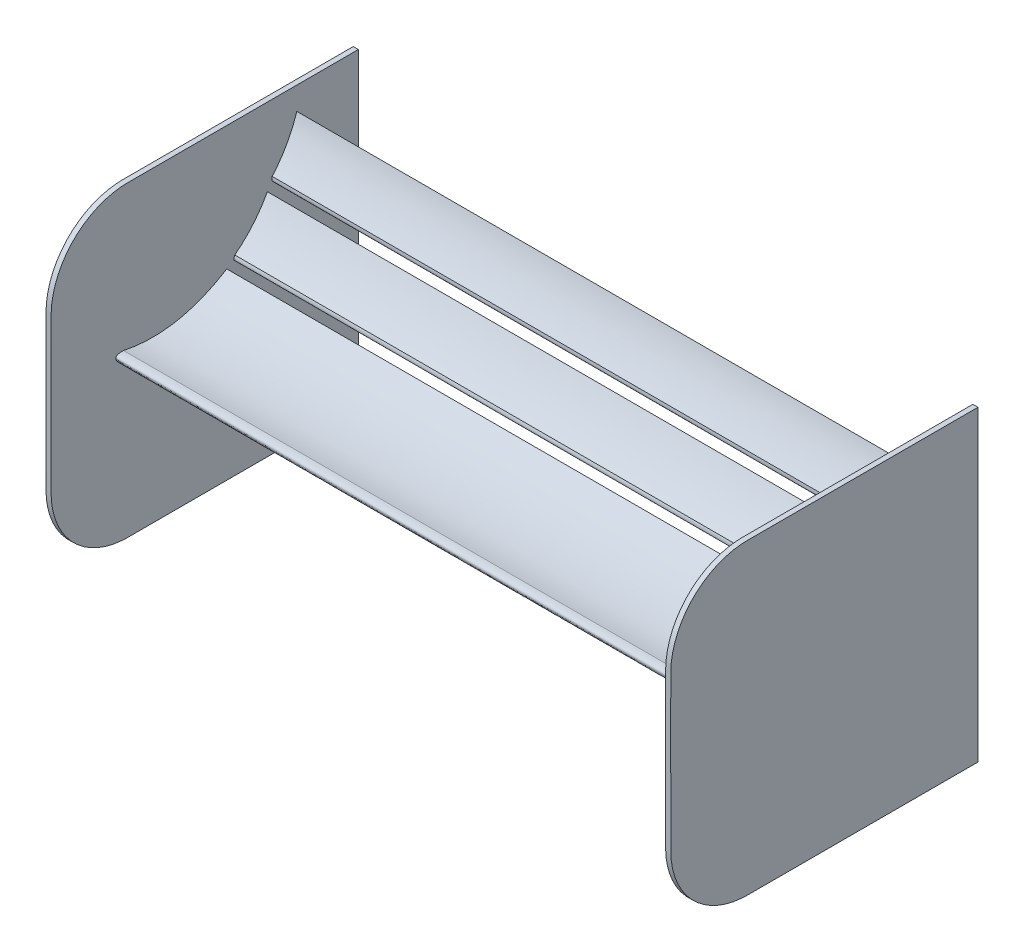
ISO-10303-21;
HEADER;
FILE_DESCRIPTION(('STEP AP214'),'2;1');
FILE_NAME('part.step','',(''),(''),'','','');
FILE_SCHEMA(('AUTOMOTIVE_DESIGN { 1 0 10303 214 1 1 1 1 }'));
ENDSEC;
DATA;
#1=APPLICATION_CONTEXT('core data for automotive mechanical design processes');
#2=APPLICATION_PROTOCOL_DEFINITION('international standard','automotive_design',2000,#1);
#3=PRODUCT_CONTEXT('',#1,'mechanical');
#4=PRODUCT('Part','Part','',(#3));
#5=PRODUCT_RELATED_PRODUCT_CATEGORY('part','',(#4));
#6=PRODUCT_DEFINITION_FORMATION('','',#4);
#7=PRODUCT_DEFINITION_CONTEXT('part definition',#1,'design');
#8=PRODUCT_DEFINITION('design','',#6,#7);
#9=PRODUCT_DEFINITION_SHAPE('','',#8);
#10=(LENGTH_UNIT() NAMED_UNIT(*) SI_UNIT(.MILLI.,.METRE.));
#11=(NAMED_UNIT(*) PLANE_ANGLE_UNIT() SI_UNIT($,.RADIAN.));
#12=(NAMED_UNIT(*) SI_UNIT($,.STERADIAN.) SOLID_ANGLE_UNIT());
#13=UNCERTAINTY_MEASURE_WITH_UNIT(LENGTH_MEASURE(1.E-05),#10,'distance_accuracy_value','');
#14=(GEOMETRIC_REPRESENTATION_CONTEXT(3) GLOBAL_UNCERTAINTY_ASSIGNED_CONTEXT((#13)) GLOBAL_UNIT_ASSIGNED_CONTEXT((#10,
#11,#12)) REPRESENTATION_CONTEXT('',''));
#15=CARTESIAN_POINT('',(0.,0.,0.));
#16=DIRECTION('',(0.,0.,1.));
#17=DIRECTION('',(1.,0.,0.));
#18=AXIS2_PLACEMENT_3D('',#15,#16,#17);
#19=CARTESIAN_POINT('',(60.,-31.4911812622665,-41.7338569603396));
#20=DIRECTION('',(1.,0.,0.));
#21=DIRECTION('',(0.,1.,0.));
#22=AXIS2_PLACEMENT_3D('',#19,#20,#21);
#23=PLANE('',#22);
#24=CARTESIAN_POINT('',(60.,5.82138868902336,-17.5994270009573));
#25=CARTESIAN_POINT('',(60.,4.35318463570384,-16.9361179050571));
#26=CARTESIAN_POINT('',(60.,5.55512101559806,-20.3679364756332));
#27=CARTESIAN_POINT('',(60.,8.51472255379222,-22.2945670478926));
#28=CARTESIAN_POINT('',(60.,11.5614396642781,-23.8482103844921));
#29=CARTESIAN_POINT('',(60.,13.3405284129489,-23.9617759981251));
#30=B_SPLINE_CURVE_WITH_KNOTS('',3,(#24,#25,#26,#27,#28,#29),.UNSPECIFIED.,.F.,.F.,(4,1,1,4),
(0.,0.228560740194618,0.553091353594912,1.),.UNSPECIFIED.);
#31=CARTESIAN_POINT('',(60.,5.82138868902336,-17.5994270009573));
#32=VERTEX_POINT('',#31);
#33=CARTESIAN_POINT('',(60.,13.3405284129489,-23.9617759981251));
#34=VERTEX_POINT('',#33);
#35=EDGE_CURVE('E200',#32,#34,#30,.T.);
#36=ORIENTED_EDGE('',*,*,#35,.T.);
#37=CARTESIAN_POINT('',(60.,13.3405284129489,-23.9617759981251));
#38=CARTESIAN_POINT('',(60.,8.90318098589373,-21.5800974414382));
#39=CARTESIAN_POINT('',(60.,5.82138868902336,-17.5994270009573));
#40=B_SPLINE_CURVE_WITH_KNOTS('',2,(#37,#38,#39),.UNSPECIFIED.,.F.,.F.,(3,3),(0.,1.),.UNSPECIFIED.);
#41=EDGE_CURVE('E206',#34,#32,#40,.T.);
#42=ORIENTED_EDGE('',*,*,#41,.T.);
#43=EDGE_LOOP('',(#36,#42));
#44=FACE_BOUND('',#43,.T.);
#45=DIRECTION('',(0.,1.,0.));
#46=VECTOR('',#45,1.);
#47=CARTESIAN_POINT('',(60.,-1.49118126226648,-41.7338569603396));
#48=LINE('',#47,#46);
#49=CARTESIAN_POINT('',(60.,-31.4911812622665,-41.7338569603396));
#50=VERTEX_POINT('',#49);
#51=CARTESIAN_POINT('',(60.,28.5088187377335,-41.7338569603396));
#52=VERTEX_POINT('',#51);
#53=EDGE_CURVE('E296',#50,#52,#48,.T.);
#54=ORIENTED_EDGE('',*,*,#53,.F.);
#55=CARTESIAN_POINT('',(60.,-31.4911812622665,-41.7338569603396));
#56=CARTESIAN_POINT('',(60.,-31.4911812622665,-38.0161503794741));
#57=CARTESIAN_POINT('',(60.,-31.4911812622665,-30.5807407268372));
#58=CARTESIAN_POINT('',(60.,-31.4911812622664,-19.3921373721535));
#59=CARTESIAN_POINT('',(60.,-31.4911812622665,-8.1313909157266));
#60=CARTESIAN_POINT('',(60.,-31.4911812622665,-0.550156633105527));
#61=CARTESIAN_POINT('',(60.,-31.4911812622665,4.21474090135208));
#62=CARTESIAN_POINT('',(59.9999999999999,-31.3104903382088,6.13441722980745));
#63=CARTESIAN_POINT('',(60.0000000000002,-30.4736086972827,8.96025081350099));
#64=CARTESIAN_POINT('',(59.9999999999999,-29.0810870178439,11.601977504099));
#65=CARTESIAN_POINT('',(60.,-27.1797903714171,13.9324082075076));
#66=CARTESIAN_POINT('',(60.,-24.8517449495851,15.8399754677755));
#67=CARTESIAN_POINT('',(60.,-22.2070726976282,17.2402567558096));
#68=CARTESIAN_POINT('',(59.9999999999999,-19.372782209908,18.0836315090511));
#69=CARTESIAN_POINT('',(60.,-17.4444992415855,18.2661430396604));
#70=CARTESIAN_POINT('',(60.,-13.9343218248166,18.2661430396604));
#71=CARTESIAN_POINT('',(60.,-8.90869635167866,18.2661430396604));
#72=CARTESIAN_POINT('',(60.,-1.49118126226648,18.2661430396604));
#73=CARTESIAN_POINT('',(60.,5.9263338271457,18.2661430396604));
#74=CARTESIAN_POINT('',(60.,10.9519593002836,18.2661430396604));
#75=CARTESIAN_POINT('',(60.,14.4621367170525,18.2661430396604));
#76=CARTESIAN_POINT('',(60.,16.3904196853749,18.0836315090511));
#77=CARTESIAN_POINT('',(60.,19.2247101730953,17.2402567558095));
#78=CARTESIAN_POINT('',(60.,21.8693824250519,15.8399754677756));
#79=CARTESIAN_POINT('',(60.,24.1974278468843,13.9324082075076));
#80=CARTESIAN_POINT('',(60.,26.0987244933108,11.601977504099));
#81=CARTESIAN_POINT('',(60.,27.4912461727498,8.96025081350101));
#82=CARTESIAN_POINT('',(60.,28.3281278136757,6.13441722980744));
#83=CARTESIAN_POINT('',(60.,28.5088187377335,4.21474090135208));
#84=CARTESIAN_POINT('',(60.,28.5088187377335,-0.550156633105499));
#85=CARTESIAN_POINT('',(60.,28.5088187377335,-8.13139091572654));
#86=CARTESIAN_POINT('',(60.,28.5088187377335,-19.3921373721536));
#87=CARTESIAN_POINT('',(60.0000000000001,28.5088187377335,-30.5807407268371));
#88=CARTESIAN_POINT('',(60.,28.5088187377335,-38.0161503794741));
#89=CARTESIAN_POINT('',(60.,28.5088187377335,-41.7338569603396));
#90=B_SPLINE_CURVE_WITH_KNOTS('',3,(#55,#56,#57,#58,#59,#60,#61,#62,#63,#64,#65,#66,#67,#68,#69,
#70,#71,#72,#73,#74,#75,#76,#77,#78,#79,#80,#81,#82,#83,#84,#85,#86,#87,#88,#89),.UNSPECIFIED.,
.F.,.F.,(4,1,1,1,2,1,1,1,1,1,1,1,2,1,1,1,2,1,1,1,1,1,1,1,2,1,1,1,4),(0.,0.0682887339802871,
0.136577467960574,0.204866201940861,0.273154935921149,0.290129113267624,0.307103290614099,
0.324077467960574,0.341051645307049,0.358025822653525,0.375,0.391974177346475,0.408948354692951,
0.454474177346475,0.5,0.545525822653525,0.59105164530705,0.608025822653525,0.625,
0.641974177346475,0.658948354692951,0.675922532039426,0.692896709385901,0.709870886732376,
0.726845064078852,0.795133798059139,0.863422532039426,0.931711266019713,1.),.UNSPECIFIED.);
#91=EDGE_CURVE('E302',#52,#50,#90,.F.);
#92=ORIENTED_EDGE('',*,*,#91,.F.);
#93=EDGE_LOOP('',(#54,#92));
#94=FACE_BOUND('',#93,.T.);
#95=CARTESIAN_POINT('',(60.,0.533202509559215,4.13171308027811));
#96=CARTESIAN_POINT('',(60.,0.626048916312408,6.85010057743224));
#97=CARTESIAN_POINT('',(60.,-1.78863279342626,4.59882683925896));
#98=CARTESIAN_POINT('',(60.,-3.02559783527262,1.81415064787273));
#99=CARTESIAN_POINT('',(60.,-3.23914719018699,-5.97063405304314));
#100=CARTESIAN_POINT('',(60.,-0.72096587224412,-12.7686705314137));
#101=CARTESIAN_POINT('',(60.,4.25145841699494,-16.0294967289289));
#102=B_SPLINE_CURVE_WITH_KNOTS('',3,(#95,#96,#97,#98,#99,#100,#101),.UNSPECIFIED.,.F.,.F.,(4,1,
1,1,4),(0.,0.155837940610663,0.221342977175901,0.368312933930499,1.),.UNSPECIFIED.);
#103=CARTESIAN_POINT('',(60.,0.533202509559215,4.13171308027811));
#104=VERTEX_POINT('',#103);
#105=CARTESIAN_POINT('',(60.,4.25145841699494,-16.0294967289289));
#106=VERTEX_POINT('',#105);
#107=EDGE_CURVE('E262',#104,#106,#102,.T.);
#108=ORIENTED_EDGE('',*,*,#107,.T.);
#109=CARTESIAN_POINT('',(60.,4.25145841699494,-16.0294967289289));
#110=CARTESIAN_POINT('',(60.,-1.7254049009481,-6.49703466013812));
#111=CARTESIAN_POINT('',(60.,0.533202509559215,4.13171308027811));
#112=B_SPLINE_CURVE_WITH_KNOTS('',2,(#109,#110,#111),.UNSPECIFIED.,.F.,.F.,(3,3),(0.,1.),.UNSPECIFIED.);
#113=EDGE_CURVE('E267',#106,#104,#112,.T.);
#114=ORIENTED_EDGE('',*,*,#113,.T.);
#115=EDGE_LOOP('',(#108,#114));
#116=FACE_BOUND('',#115,.T.);
#117=CARTESIAN_POINT('',(60.,15.4645912440343,-24.9000805307909));
#118=CARTESIAN_POINT('',(60.,13.896796892235,-24.5291048316488));
#119=CARTESIAN_POINT('',(60.,15.73147216928,-27.6685309560327));
#120=CARTESIAN_POINT('',(60.,19.0043159352995,-28.9950453020061));
#121=CARTESIAN_POINT('',(60.,22.2915053954575,-29.9388028035461));
#122=CARTESIAN_POINT('',(60.,24.0595766135654,-29.7108157601737));
#123=B_SPLINE_CURVE_WITH_KNOTS('',3,(#117,#118,#119,#120,#121,#122),.UNSPECIFIED.,.F.,.F.,(4,1,
1,4),(0.,0.228560740194618,0.553091353594911,1.),.UNSPECIFIED.);
#124=CARTESIAN_POINT('',(60.,15.4645912440343,-24.9000805307909));
#125=VERTEX_POINT('',#124);
#126=CARTESIAN_POINT('',(60.,24.0595766135654,-29.7108157601737));
#127=VERTEX_POINT('',#126);
#128=EDGE_CURVE('E173',#125,#127,#123,.T.);
#129=ORIENTED_EDGE('',*,*,#128,.T.);
#130=CARTESIAN_POINT('',(60.,24.0595766135654,-29.7108157601737));
#131=CARTESIAN_POINT('',(60.,19.2493100640552,-28.2195811513885));
#132=CARTESIAN_POINT('',(60.,15.4645912440343,-24.9000805307909));
#133=B_SPLINE_CURVE_WITH_KNOTS('',2,(#130,#131,#132),.UNSPECIFIED.,.F.,.F.,(3,3),(0.,1.),.UNSPECIFIED.);
#134=EDGE_CURVE('E113',#127,#125,#133,.T.);
#135=ORIENTED_EDGE('',*,*,#134,.T.);
#136=EDGE_LOOP('',(#129,#135));
#137=FACE_BOUND('',#136,.T.);
#138=ADVANCED_FACE('F97',(#44,#94,#116,#137),#23,.F.);
#139=CARTESIAN_POINT('',(-60.,-31.4911812622665,-41.7338569603396));
#140=DIRECTION('',(-1.,0.,0.));
#141=DIRECTION('',(0.,1.,0.));
#142=AXIS2_PLACEMENT_3D('',#139,#140,#141);
#143=PLANE('',#142);
#144=CARTESIAN_POINT('',(-60.,5.82138868902336,-17.5994270009573));
#145=CARTESIAN_POINT('',(-60.,4.35318463570384,-16.9361179050571));
#146=CARTESIAN_POINT('',(-60.,5.55512101559806,-20.3679364756332));
#147=CARTESIAN_POINT('',(-60.,8.51472255379222,-22.2945670478926));
#148=CARTESIAN_POINT('',(-60.,11.5614396642781,-23.8482103844921));
#149=CARTESIAN_POINT('',(-60.,13.3405284129489,-23.9617759981251));
#150=B_SPLINE_CURVE_WITH_KNOTS('',3,(#144,#145,#146,#147,#148,#149),.UNSPECIFIED.,.F.,.F.,(4,1,
1,4),(0.,0.228560740194618,0.553091353594912,1.),.UNSPECIFIED.);
#151=CARTESIAN_POINT('',(-60.,5.82138868902336,-17.5994270009573));
#152=VERTEX_POINT('',#151);
#153=CARTESIAN_POINT('',(-60.,13.3405284129489,-23.9617759981251));
#154=VERTEX_POINT('',#153);
#155=EDGE_CURVE('E189',#152,#154,#150,.T.);
#156=ORIENTED_EDGE('',*,*,#155,.F.);
#157=CARTESIAN_POINT('',(-60.,13.3405284129489,-23.9617759981251));
#158=CARTESIAN_POINT('',(-60.,8.90318098589373,-21.5800974414382));
#159=CARTESIAN_POINT('',(-60.,5.82138868902336,-17.5994270009573));
#160=B_SPLINE_CURVE_WITH_KNOTS('',2,(#157,#158,#159),.UNSPECIFIED.,.F.,.F.,(3,3),(0.,1.),.UNSPECIFIED.);
#161=EDGE_CURVE('E194',#154,#152,#160,.T.);
#162=ORIENTED_EDGE('',*,*,#161,.F.);
#163=EDGE_LOOP('',(#156,#162));
#164=FACE_BOUND('',#163,.T.);
#165=CARTESIAN_POINT('',(-60.,0.533202509559215,4.13171308027811));
#166=CARTESIAN_POINT('',(-60.,0.626048916312408,6.85010057743224));
#167=CARTESIAN_POINT('',(-60.,-1.78863279342626,4.59882683925896));
#168=CARTESIAN_POINT('',(-60.,-3.02559783527262,1.81415064787273));
#169=CARTESIAN_POINT('',(-60.,-3.23914719018699,-5.97063405304314));
#170=CARTESIAN_POINT('',(-60.,-0.72096587224412,-12.7686705314137));
#171=CARTESIAN_POINT('',(-60.,4.25145841699494,-16.0294967289289));
#172=B_SPLINE_CURVE_WITH_KNOTS('',3,(#165,#166,#167,#168,#169,#170,#171),.UNSPECIFIED.,.F.,.F.,
(4,1,1,1,4),(0.,0.155837940610663,0.221342977175901,0.368312933930499,1.),.UNSPECIFIED.);
#173=CARTESIAN_POINT('',(-60.,0.533202509559215,4.13171308027811));
#174=VERTEX_POINT('',#173);
#175=CARTESIAN_POINT('',(-60.,4.25145841699494,-16.0294967289289));
#176=VERTEX_POINT('',#175);
#177=EDGE_CURVE('E256',#174,#176,#172,.T.);
#178=ORIENTED_EDGE('',*,*,#177,.F.);
#179=CARTESIAN_POINT('',(-60.,4.25145841699494,-16.0294967289289));
#180=CARTESIAN_POINT('',(-60.,-1.7254049009481,-6.49703466013812));
#181=CARTESIAN_POINT('',(-60.,0.533202509559215,4.13171308027811));
#182=B_SPLINE_CURVE_WITH_KNOTS('',2,(#179,#180,#181),.UNSPECIFIED.,.F.,.F.,(3,3),(0.,1.),.UNSPECIFIED.);
#183=EDGE_CURVE('E268',#176,#174,#182,.T.);
#184=ORIENTED_EDGE('',*,*,#183,.F.);
#185=EDGE_LOOP('',(#178,#184));
#186=FACE_BOUND('',#185,.T.);
#187=DIRECTION('',(0.,1.,0.));
#188=VECTOR('',#187,1.);
#189=CARTESIAN_POINT('',(-60.,-1.49118126226648,-41.7338569603396));
#190=LINE('',#189,#188);
#191=CARTESIAN_POINT('',(-60.,-31.4911812622665,-41.7338569603396));
#192=VERTEX_POINT('',#191);
#193=CARTESIAN_POINT('',(-60.,28.5088187377335,-41.7338569603396));
#194=VERTEX_POINT('',#193);
#195=EDGE_CURVE('E247',#192,#194,#190,.T.);
#196=ORIENTED_EDGE('',*,*,#195,.T.);
#197=CARTESIAN_POINT('',(-60.,-31.4911812622665,-41.7338569603396));
#198=CARTESIAN_POINT('',(-60.,-31.4911812622665,-38.0161503794741));
#199=CARTESIAN_POINT('',(-60.,-31.4911812622665,-30.5807407268372));
#200=CARTESIAN_POINT('',(-60.,-31.4911812622664,-19.3921373721535));
#201=CARTESIAN_POINT('',(-60.,-31.4911812622665,-8.1313909157266));
#202=CARTESIAN_POINT('',(-60.,-31.4911812622665,-0.550156633105527));
#203=CARTESIAN_POINT('',(-60.,-31.4911812622665,4.21474090135208));
#204=CARTESIAN_POINT('',(-59.9999999999999,-31.3104903382088,6.13441722980745));
#205=CARTESIAN_POINT('',(-60.0000000000002,-30.4736086972827,8.96025081350099));
#206=CARTESIAN_POINT('',(-59.9999999999999,-29.0810870178439,11.601977504099));
#207=CARTESIAN_POINT('',(-60.,-27.1797903714171,13.9324082075076));
#208=CARTESIAN_POINT('',(-60.,-24.8517449495851,15.8399754677755));
#209=CARTESIAN_POINT('',(-60.,-22.2070726976282,17.2402567558096));
#210=CARTESIAN_POINT('',(-59.9999999999999,-19.372782209908,18.0836315090511));
#211=CARTESIAN_POINT('',(-60.,-17.4444992415855,18.2661430396604));
#212=CARTESIAN_POINT('',(-60.,-13.9343218248166,18.2661430396604));
#213=CARTESIAN_POINT('',(-60.,-8.90869635167866,18.2661430396604));
#214=CARTESIAN_POINT('',(-60.,-1.49118126226648,18.2661430396604));
#215=CARTESIAN_POINT('',(-60.,5.9263338271457,18.2661430396604));
#216=CARTESIAN_POINT('',(-60.,10.9519593002836,18.2661430396604));
#217=CARTESIAN_POINT('',(-60.,14.4621367170525,18.2661430396604));
#218=CARTESIAN_POINT('',(-60.,16.3904196853749,18.0836315090511));
#219=CARTESIAN_POINT('',(-60.,19.2247101730953,17.2402567558095));
#220=CARTESIAN_POINT('',(-60.,21.8693824250519,15.8399754677756));
#221=CARTESIAN_POINT('',(-60.,24.1974278468843,13.9324082075076));
#222=CARTESIAN_POINT('',(-60.,26.0987244933108,11.601977504099));
#223=CARTESIAN_POINT('',(-60.,27.4912461727498,8.96025081350101));
#224=CARTESIAN_POINT('',(-60.,28.3281278136757,6.13441722980744));
#225=CARTESIAN_POINT('',(-60.,28.5088187377335,4.21474090135208));
#226=CARTESIAN_POINT('',(-60.,28.5088187377335,-0.550156633105499));
#227=CARTESIAN_POINT('',(-60.,28.5088187377335,-8.13139091572654));
#228=CARTESIAN_POINT('',(-60.,28.5088187377335,-19.3921373721536));
#229=CARTESIAN_POINT('',(-60.0000000000001,28.5088187377335,-30.5807407268371));
#230=CARTESIAN_POINT('',(-60.,28.5088187377335,-38.0161503794741));
#231=CARTESIAN_POINT('',(-60.,28.5088187377335,-41.7338569603396));
#232=B_SPLINE_CURVE_WITH_KNOTS('',3,(#197,#198,#199,#200,#201,#202,#203,#204,#205,#206,#207,
#208,#209,#210,#211,#212,#213,#214,#215,#216,#217,#218,#219,#220,#221,#222,#223,#224,#225,#226,
#227,#228,#229,#230,#231),.UNSPECIFIED.,.F.,.F.,(4,1,1,1,2,1,1,1,1,1,1,1,2,1,1,1,2,1,1,1,1,1,1,
1,2,1,1,1,4),(0.,0.0682887339802871,0.136577467960574,0.204866201940861,0.273154935921149,
0.290129113267624,0.307103290614099,0.324077467960574,0.341051645307049,0.358025822653525,0.375,
0.391974177346475,0.408948354692951,0.454474177346475,0.5,0.545525822653525,0.59105164530705,
0.608025822653525,0.625,0.641974177346475,0.658948354692951,0.675922532039426,0.692896709385901,
0.709870886732376,0.726845064078852,0.795133798059139,0.863422532039426,0.931711266019713,1.),.UNSPECIFIED.);
#233=EDGE_CURVE('E371',#194,#192,#232,.F.);
#234=ORIENTED_EDGE('',*,*,#233,.T.);
#235=EDGE_LOOP('',(#196,#234));
#236=FACE_BOUND('',#235,.T.);
#237=CARTESIAN_POINT('',(-60.,15.4645912440343,-24.9000805307909));
#238=CARTESIAN_POINT('',(-60.,13.896796892235,-24.5291048316488));
#239=CARTESIAN_POINT('',(-60.,15.73147216928,-27.6685309560327));
#240=CARTESIAN_POINT('',(-60.,19.0043159352995,-28.9950453020061));
#241=CARTESIAN_POINT('',(-60.,22.2915053954575,-29.9388028035461));
#242=CARTESIAN_POINT('',(-60.,24.0595766135654,-29.7108157601737));
#243=B_SPLINE_CURVE_WITH_KNOTS('',3,(#237,#238,#239,#240,#241,#242),.UNSPECIFIED.,.F.,.F.,(4,1,
1,4),(0.,0.228560740194618,0.553091353594911,1.),.UNSPECIFIED.);
#244=CARTESIAN_POINT('',(-60.,15.4645912440343,-24.9000805307909));
#245=VERTEX_POINT('',#244);
#246=CARTESIAN_POINT('',(-60.,24.0595766135654,-29.7108157601737));
#247=VERTEX_POINT('',#246);
#248=EDGE_CURVE('E187',#245,#247,#243,.T.);
#249=ORIENTED_EDGE('',*,*,#248,.F.);
#250=CARTESIAN_POINT('',(-60.,24.0595766135654,-29.7108157601737));
#251=CARTESIAN_POINT('',(-60.,19.2493100640552,-28.2195811513885));
#252=CARTESIAN_POINT('',(-60.,15.4645912440343,-24.9000805307909));
#253=B_SPLINE_CURVE_WITH_KNOTS('',2,(#250,#251,#252),.UNSPECIFIED.,.F.,.F.,(3,3),(0.,1.),.UNSPECIFIED.);
#254=EDGE_CURVE('E120',#247,#245,#253,.T.);
#255=ORIENTED_EDGE('',*,*,#254,.F.);
#256=EDGE_LOOP('',(#249,#255));
#257=FACE_BOUND('',#256,.T.);
#258=ADVANCED_FACE('F226',(#164,#186,#236,#257),#143,.F.);
#259=CARTESIAN_POINT('',(60.,-1.49118126226648,-41.7338569603396));
#260=DIRECTION('',(0.,0.,-1.));
#261=DIRECTION('',(0.,1.,0.));
#262=AXIS2_PLACEMENT_3D('',#259,#260,#261);
#263=PLANE('',#262);
#264=DIRECTION('',(1.,0.,0.));
#265=VECTOR('',#264,1.);
#266=CARTESIAN_POINT('',(60.,-31.4911812622665,-41.7338569603396));
#267=LINE('',#266,#265);
#268=CARTESIAN_POINT('',(61.,-31.4911812622665,-41.7338569603396));
#269=VERTEX_POINT('',#268);
#270=EDGE_CURVE('E12',#50,#269,#267,.T.);
#271=ORIENTED_EDGE('',*,*,#270,.F.);
#272=ORIENTED_EDGE('',*,*,#53,.T.);
#273=DIRECTION('',(1.,0.,0.));
#274=VECTOR('',#273,1.);
#275=CARTESIAN_POINT('',(60.,28.5088187377335,-41.7338569603396));
#276=LINE('',#275,#274);
#277=CARTESIAN_POINT('',(61.,28.5088187377335,-41.7338569603396));
#278=VERTEX_POINT('',#277);
#279=EDGE_CURVE('E102',#52,#278,#276,.T.);
#280=ORIENTED_EDGE('',*,*,#279,.T.);
#281=DIRECTION('',(0.,1.,0.));
#282=VECTOR('',#281,1.);
#283=CARTESIAN_POINT('',(61.,-31.4911812622665,-41.7338569603396));
#284=LINE('',#283,#282);
#285=EDGE_CURVE('E298',#269,#278,#284,.T.);
#286=ORIENTED_EDGE('',*,*,#285,.F.);
#287=EDGE_LOOP('',(#271,#272,#280,#286));
#288=FACE_BOUND('',#287,.T.);
#289=ADVANCED_FACE('F229',(#288),#263,.T.);
#290=CARTESIAN_POINT('',(60.,-31.4911812622665,-41.7338569603396));
#291=CARTESIAN_POINT('',(60.,-31.4911812622665,-38.0161503794741));
#292=CARTESIAN_POINT('',(60.,-31.4911812622665,-30.5807407268372));
#293=CARTESIAN_POINT('',(60.,-31.4911812622664,-19.3921373721535));
#294=CARTESIAN_POINT('',(60.,-31.4911812622665,-8.1313909157266));
#295=CARTESIAN_POINT('',(60.,-31.4911812622665,-0.550156633105527));
#296=CARTESIAN_POINT('',(60.,-31.4911812622665,4.21474090135208));
#297=CARTESIAN_POINT('',(59.9999999999999,-31.3104903382088,6.13441722980745));
#298=CARTESIAN_POINT('',(60.0000000000002,-30.4736086972827,8.96025081350099));
#299=CARTESIAN_POINT('',(59.9999999999999,-29.0810870178439,11.601977504099));
#300=CARTESIAN_POINT('',(60.,-27.1797903714171,13.9324082075076));
#301=CARTESIAN_POINT('',(60.,-24.8517449495851,15.8399754677755));
#302=CARTESIAN_POINT('',(60.,-22.2070726976282,17.2402567558096));
#303=CARTESIAN_POINT('',(59.9999999999999,-19.372782209908,18.0836315090511));
#304=CARTESIAN_POINT('',(60.,-17.4444992415855,18.2661430396604));
#305=CARTESIAN_POINT('',(60.,-13.9343218248166,18.2661430396604));
#306=CARTESIAN_POINT('',(60.,-8.90869635167866,18.2661430396604));
#307=CARTESIAN_POINT('',(60.,-1.49118126226648,18.2661430396604));
#308=CARTESIAN_POINT('',(60.,5.9263338271457,18.2661430396604));
#309=CARTESIAN_POINT('',(60.,10.9519593002836,18.2661430396604));
#310=CARTESIAN_POINT('',(60.,14.4621367170525,18.2661430396604));
#311=CARTESIAN_POINT('',(60.,16.3904196853749,18.0836315090511));
#312=CARTESIAN_POINT('',(60.,19.2247101730953,17.2402567558095));
#313=CARTESIAN_POINT('',(60.,21.8693824250519,15.8399754677756));
#314=CARTESIAN_POINT('',(60.,24.1974278468843,13.9324082075076));
#315=CARTESIAN_POINT('',(60.,26.0987244933108,11.601977504099));
#316=CARTESIAN_POINT('',(60.,27.4912461727498,8.96025081350101));
#317=CARTESIAN_POINT('',(60.,28.3281278136757,6.13441722980744));
#318=CARTESIAN_POINT('',(60.,28.5088187377335,4.21474090135208));
#319=CARTESIAN_POINT('',(60.,28.5088187377335,-0.550156633105499));
#320=CARTESIAN_POINT('',(60.,28.5088187377335,-8.13139091572654));
#321=CARTESIAN_POINT('',(60.,28.5088187377335,-19.3921373721536));
#322=CARTESIAN_POINT('',(60.0000000000001,28.5088187377335,-30.5807407268371));
#323=CARTESIAN_POINT('',(60.,28.5088187377335,-38.0161503794741));
#324=CARTESIAN_POINT('',(60.,28.5088187377335,-41.7338569603396));
#325=B_SPLINE_CURVE_WITH_KNOTS('',3,(#290,#291,#292,#293,#294,#295,#296,#297,#298,#299,#300,
#301,#302,#303,#304,#305,#306,#307,#308,#309,#310,#311,#312,#313,#314,#315,#316,#317,#318,#319,
#320,#321,#322,#323,#324),.UNSPECIFIED.,.F.,.F.,(4,1,1,1,2,1,1,1,1,1,1,1,2,1,1,1,2,1,1,1,1,1,1,
1,2,1,1,1,4),(0.,0.0682887339802871,0.136577467960574,0.204866201940861,0.273154935921149,
0.290129113267624,0.307103290614099,0.324077467960574,0.341051645307049,0.358025822653525,0.375,
0.391974177346475,0.408948354692951,0.454474177346475,0.5,0.545525822653525,0.59105164530705,
0.608025822653525,0.625,0.641974177346475,0.658948354692951,0.675922532039426,0.692896709385901,
0.709870886732376,0.726845064078852,0.795133798059139,0.863422532039426,0.931711266019713,1.),.UNSPECIFIED.);
#326=DIRECTION('',(1.,0.,0.));
#327=VECTOR('',#326,1.);
#328=SURFACE_OF_LINEAR_EXTRUSION('',#325,#327);
#329=ORIENTED_EDGE('',*,*,#91,.T.);
#330=ORIENTED_EDGE('',*,*,#270,.T.);
#331=CARTESIAN_POINT('',(61.,-31.4911812622665,-41.7338569603396));
#332=CARTESIAN_POINT('',(61.,-31.4911812622665,-38.0161503794741));
#333=CARTESIAN_POINT('',(61.,-31.4911812622665,-30.5807407268372));
#334=CARTESIAN_POINT('',(61.,-31.4911812622664,-19.3921373721535));
#335=CARTESIAN_POINT('',(61.,-31.4911812622665,-8.1313909157266));
#336=CARTESIAN_POINT('',(61.,-31.4911812622665,-0.550156633105527));
#337=CARTESIAN_POINT('',(61.,-31.4911812622665,4.21474090135208));
#338=CARTESIAN_POINT('',(60.9999999999999,-31.3104903382088,6.13441722980745));
#339=CARTESIAN_POINT('',(61.0000000000002,-30.4736086972827,8.96025081350099));
#340=CARTESIAN_POINT('',(60.9999999999999,-29.0810870178439,11.601977504099));
#341=CARTESIAN_POINT('',(61.,-27.1797903714171,13.9324082075076));
#342=CARTESIAN_POINT('',(61.,-24.8517449495851,15.8399754677755));
#343=CARTESIAN_POINT('',(61.,-22.2070726976282,17.2402567558096));
#344=CARTESIAN_POINT('',(60.9999999999999,-19.372782209908,18.0836315090511));
#345=CARTESIAN_POINT('',(61.,-17.4444992415855,18.2661430396604));
#346=CARTESIAN_POINT('',(61.,-13.9343218248166,18.2661430396604));
#347=CARTESIAN_POINT('',(61.,-8.90869635167866,18.2661430396604));
#348=CARTESIAN_POINT('',(61.,-1.49118126226648,18.2661430396604));
#349=CARTESIAN_POINT('',(61.,5.9263338271457,18.2661430396604));
#350=CARTESIAN_POINT('',(61.,10.9519593002836,18.2661430396604));
#351=CARTESIAN_POINT('',(61.,14.4621367170525,18.2661430396604));
#352=CARTESIAN_POINT('',(61.,16.3904196853749,18.0836315090511));
#353=CARTESIAN_POINT('',(61.,19.2247101730953,17.2402567558095));
#354=CARTESIAN_POINT('',(61.,21.8693824250519,15.8399754677756));
#355=CARTESIAN_POINT('',(61.,24.1974278468843,13.9324082075076));
#356=CARTESIAN_POINT('',(61.,26.0987244933108,11.601977504099));
#357=CARTESIAN_POINT('',(61.,27.4912461727498,8.96025081350101));
#358=CARTESIAN_POINT('',(61.,28.3281278136757,6.13441722980744));
#359=CARTESIAN_POINT('',(61.,28.5088187377335,4.21474090135208));
#360=CARTESIAN_POINT('',(61.,28.5088187377335,-0.550156633105499));
#361=CARTESIAN_POINT('',(61.,28.5088187377335,-8.13139091572654));
#362=CARTESIAN_POINT('',(61.,28.5088187377335,-19.3921373721536));
#363=CARTESIAN_POINT('',(61.0000000000001,28.5088187377335,-30.5807407268371));
#364=CARTESIAN_POINT('',(61.,28.5088187377335,-38.0161503794741));
#365=CARTESIAN_POINT('',(61.,28.5088187377335,-41.7338569603396));
#366=B_SPLINE_CURVE_WITH_KNOTS('',3,(#331,#332,#333,#334,#335,#336,#337,#338,#339,#340,#341,
#342,#343,#344,#345,#346,#347,#348,#349,#350,#351,#352,#353,#354,#355,#356,#357,#358,#359,#360,
#361,#362,#363,#364,#365),.UNSPECIFIED.,.F.,.F.,(4,1,1,1,2,1,1,1,1,1,1,1,2,1,1,1,2,1,1,1,1,1,1,
1,2,1,1,1,4),(0.,0.0682887339802871,0.136577467960574,0.204866201940861,0.273154935921149,
0.290129113267624,0.307103290614099,0.324077467960574,0.341051645307049,0.358025822653525,0.375,
0.391974177346475,0.408948354692951,0.454474177346475,0.5,0.545525822653525,0.59105164530705,
0.608025822653525,0.625,0.641974177346475,0.658948354692951,0.675922532039426,0.692896709385901,
0.709870886732376,0.726845064078852,0.795133798059139,0.863422532039426,0.931711266019713,1.),.UNSPECIFIED.);
#367=EDGE_CURVE('E309',#278,#269,#366,.F.);
#368=ORIENTED_EDGE('',*,*,#367,.F.);
#369=ORIENTED_EDGE('',*,*,#279,.F.);
#370=EDGE_LOOP('',(#329,#330,#368,#369));
#371=FACE_BOUND('',#370,.T.);
#372=ADVANCED_FACE('F99',(#371),#328,.F.);
#373=CARTESIAN_POINT('',(61.,-31.4911812622665,-41.7338569603396));
#374=DIRECTION('',(1.,0.,0.));
#375=DIRECTION('',(0.,1.,0.));
#376=AXIS2_PLACEMENT_3D('',#373,#374,#375);
#377=PLANE('',#376);
#378=ORIENTED_EDGE('',*,*,#285,.T.);
#379=ORIENTED_EDGE('',*,*,#367,.T.);
#380=EDGE_LOOP('',(#378,#379));
#381=FACE_BOUND('',#380,.T.);
#382=ADVANCED_FACE('F279',(#381),#377,.T.);
#383=DIRECTION('',(-1.,0.,0.));
#384=VECTOR('',#383,1.);
#385=SURFACE_OF_LINEAR_EXTRUSION('',#102,#384);
#386=ORIENTED_EDGE('',*,*,#177,.T.);
#387=DIRECTION('',(-1.,0.,0.));
#388=VECTOR('',#387,1.);
#389=CARTESIAN_POINT('',(60.,4.25145841699494,-16.0294967289289));
#390=LINE('',#389,#388);
#391=EDGE_CURVE('E305',#106,#176,#390,.T.);
#392=ORIENTED_EDGE('',*,*,#391,.F.);
#393=ORIENTED_EDGE('',*,*,#107,.F.);
#394=DIRECTION('',(-1.,0.,0.));
#395=VECTOR('',#394,1.);
#396=CARTESIAN_POINT('',(60.,0.533202509559215,4.13171308027811));
#397=LINE('',#396,#395);
#398=EDGE_CURVE('E336',#104,#174,#397,.T.);
#399=ORIENTED_EDGE('',*,*,#398,.T.);
#400=EDGE_LOOP('',(#386,#392,#393,#399));
#401=FACE_BOUND('',#400,.T.);
#402=ADVANCED_FACE('F276',(#401),#385,.F.);
#403=DIRECTION('',(-1.,0.,0.));
#404=VECTOR('',#403,1.);
#405=SURFACE_OF_LINEAR_EXTRUSION('',#112,#404);
#406=ORIENTED_EDGE('',*,*,#183,.T.);
#407=ORIENTED_EDGE('',*,*,#398,.F.);
#408=ORIENTED_EDGE('',*,*,#113,.F.);
#409=ORIENTED_EDGE('',*,*,#391,.T.);
#410=EDGE_LOOP('',(#406,#407,#408,#409));
#411=FACE_BOUND('',#410,.T.);
#412=ADVANCED_FACE('F234',(#411),#405,.F.);
#413=CARTESIAN_POINT('',(-60.,-1.49118126226648,-41.7338569603396));
#414=DIRECTION('',(0.,0.,-1.));
#415=DIRECTION('',(0.,1.,0.));
#416=AXIS2_PLACEMENT_3D('',#413,#414,#415);
#417=PLANE('',#416);
#418=DIRECTION('',(-1.,0.,0.));
#419=VECTOR('',#418,1.);
#420=CARTESIAN_POINT('',(-60.,-31.4911812622665,-41.7338569603396));
#421=LINE('',#420,#419);
#422=CARTESIAN_POINT('',(-61.,-31.4911812622665,-41.7338569603396));
#423=VERTEX_POINT('',#422);
#424=EDGE_CURVE('E249',#192,#423,#421,.T.);
#425=ORIENTED_EDGE('',*,*,#424,.T.);
#426=DIRECTION('',(0.,1.,0.));
#427=VECTOR('',#426,1.);
#428=CARTESIAN_POINT('',(-61.,-31.4911812622665,-41.7338569603396));
#429=LINE('',#428,#427);
#430=CARTESIAN_POINT('',(-61.,28.5088187377335,-41.7338569603396));
#431=VERTEX_POINT('',#430);
#432=EDGE_CURVE('E261',#423,#431,#429,.T.);
#433=ORIENTED_EDGE('',*,*,#432,.T.);
#434=DIRECTION('',(-1.,0.,0.));
#435=VECTOR('',#434,1.);
#436=CARTESIAN_POINT('',(-60.,28.5088187377335,-41.7338569603396));
#437=LINE('',#436,#435);
#438=EDGE_CURVE('E257',#194,#431,#437,.T.);
#439=ORIENTED_EDGE('',*,*,#438,.F.);
#440=ORIENTED_EDGE('',*,*,#195,.F.);
#441=EDGE_LOOP('',(#425,#433,#439,#440));
#442=FACE_BOUND('',#441,.T.);
#443=ADVANCED_FACE('F231',(#442),#417,.T.);
#444=CARTESIAN_POINT('',(-60.,-31.4911812622665,-41.7338569603396));
#445=CARTESIAN_POINT('',(-60.,-31.4911812622665,-38.0161503794741));
#446=CARTESIAN_POINT('',(-60.,-31.4911812622665,-30.5807407268372));
#447=CARTESIAN_POINT('',(-60.,-31.4911812622664,-19.3921373721535));
#448=CARTESIAN_POINT('',(-60.,-31.4911812622665,-8.1313909157266));
#449=CARTESIAN_POINT('',(-60.,-31.4911812622665,-0.550156633105527));
#450=CARTESIAN_POINT('',(-60.,-31.4911812622665,4.21474090135208));
#451=CARTESIAN_POINT('',(-59.9999999999999,-31.3104903382088,6.13441722980745));
#452=CARTESIAN_POINT('',(-60.0000000000002,-30.4736086972827,8.96025081350099));
#453=CARTESIAN_POINT('',(-59.9999999999999,-29.0810870178439,11.601977504099));
#454=CARTESIAN_POINT('',(-60.,-27.1797903714171,13.9324082075076));
#455=CARTESIAN_POINT('',(-60.,-24.8517449495851,15.8399754677755));
#456=CARTESIAN_POINT('',(-60.,-22.2070726976282,17.2402567558096));
#457=CARTESIAN_POINT('',(-59.9999999999999,-19.372782209908,18.0836315090511));
#458=CARTESIAN_POINT('',(-60.,-17.4444992415855,18.2661430396604));
#459=CARTESIAN_POINT('',(-60.,-13.9343218248166,18.2661430396604));
#460=CARTESIAN_POINT('',(-60.,-8.90869635167866,18.2661430396604));
#461=CARTESIAN_POINT('',(-60.,-1.49118126226648,18.2661430396604));
#462=CARTESIAN_POINT('',(-60.,5.9263338271457,18.2661430396604));
#463=CARTESIAN_POINT('',(-60.,10.9519593002836,18.2661430396604));
#464=CARTESIAN_POINT('',(-60.,14.4621367170525,18.2661430396604));
#465=CARTESIAN_POINT('',(-60.,16.3904196853749,18.0836315090511));
#466=CARTESIAN_POINT('',(-60.,19.2247101730953,17.2402567558095));
#467=CARTESIAN_POINT('',(-60.,21.8693824250519,15.8399754677756));
#468=CARTESIAN_POINT('',(-60.,24.1974278468843,13.9324082075076));
#469=CARTESIAN_POINT('',(-60.,26.0987244933108,11.601977504099));
#470=CARTESIAN_POINT('',(-60.,27.4912461727498,8.96025081350101));
#471=CARTESIAN_POINT('',(-60.,28.3281278136757,6.13441722980744));
#472=CARTESIAN_POINT('',(-60.,28.5088187377335,4.21474090135208));
#473=CARTESIAN_POINT('',(-60.,28.5088187377335,-0.550156633105499));
#474=CARTESIAN_POINT('',(-60.,28.5088187377335,-8.13139091572654));
#475=CARTESIAN_POINT('',(-60.,28.5088187377335,-19.3921373721536));
#476=CARTESIAN_POINT('',(-60.0000000000001,28.5088187377335,-30.5807407268371));
#477=CARTESIAN_POINT('',(-60.,28.5088187377335,-38.0161503794741));
#478=CARTESIAN_POINT('',(-60.,28.5088187377335,-41.7338569603396));
#479=B_SPLINE_CURVE_WITH_KNOTS('',3,(#444,#445,#446,#447,#448,#449,#450,#451,#452,#453,#454,
#455,#456,#457,#458,#459,#460,#461,#462,#463,#464,#465,#466,#467,#468,#469,#470,#471,#472,#473,
#474,#475,#476,#477,#478),.UNSPECIFIED.,.F.,.F.,(4,1,1,1,2,1,1,1,1,1,1,1,2,1,1,1,2,1,1,1,1,1,1,
1,2,1,1,1,4),(0.,0.0682887339802871,0.136577467960574,0.204866201940861,0.273154935921149,
0.290129113267624,0.307103290614099,0.324077467960574,0.341051645307049,0.358025822653525,0.375,
0.391974177346475,0.408948354692951,0.454474177346475,0.5,0.545525822653525,0.59105164530705,
0.608025822653525,0.625,0.641974177346475,0.658948354692951,0.675922532039426,0.692896709385901,
0.709870886732376,0.726845064078852,0.795133798059139,0.863422532039426,0.931711266019713,1.),.UNSPECIFIED.);
#480=DIRECTION('',(-1.,0.,0.));
#481=VECTOR('',#480,1.);
#482=SURFACE_OF_LINEAR_EXTRUSION('',#479,#481);
#483=ORIENTED_EDGE('',*,*,#233,.F.);
#484=ORIENTED_EDGE('',*,*,#438,.T.);
#485=CARTESIAN_POINT('',(-61.,-31.4911812622665,-41.7338569603396));
#486=CARTESIAN_POINT('',(-61.,-31.4911812622665,-38.0161503794741));
#487=CARTESIAN_POINT('',(-61.,-31.4911812622665,-30.5807407268372));
#488=CARTESIAN_POINT('',(-61.,-31.4911812622664,-19.3921373721535));
#489=CARTESIAN_POINT('',(-61.,-31.4911812622665,-8.1313909157266));
#490=CARTESIAN_POINT('',(-61.,-31.4911812622665,-0.550156633105527));
#491=CARTESIAN_POINT('',(-61.,-31.4911812622665,4.21474090135208));
#492=CARTESIAN_POINT('',(-60.9999999999999,-31.3104903382088,6.13441722980745));
#493=CARTESIAN_POINT('',(-61.0000000000002,-30.4736086972827,8.96025081350099));
#494=CARTESIAN_POINT('',(-60.9999999999999,-29.0810870178439,11.601977504099));
#495=CARTESIAN_POINT('',(-61.,-27.1797903714171,13.9324082075076));
#496=CARTESIAN_POINT('',(-61.,-24.8517449495851,15.8399754677755));
#497=CARTESIAN_POINT('',(-61.,-22.2070726976282,17.2402567558096));
#498=CARTESIAN_POINT('',(-60.9999999999999,-19.372782209908,18.0836315090511));
#499=CARTESIAN_POINT('',(-61.,-17.4444992415855,18.2661430396604));
#500=CARTESIAN_POINT('',(-61.,-13.9343218248166,18.2661430396604));
#501=CARTESIAN_POINT('',(-61.,-8.90869635167866,18.2661430396604));
#502=CARTESIAN_POINT('',(-61.,-1.49118126226648,18.2661430396604));
#503=CARTESIAN_POINT('',(-61.,5.9263338271457,18.2661430396604));
#504=CARTESIAN_POINT('',(-61.,10.9519593002836,18.2661430396604));
#505=CARTESIAN_POINT('',(-61.,14.4621367170525,18.2661430396604));
#506=CARTESIAN_POINT('',(-61.,16.3904196853749,18.0836315090511));
#507=CARTESIAN_POINT('',(-61.,19.2247101730953,17.2402567558095));
#508=CARTESIAN_POINT('',(-61.,21.8693824250519,15.8399754677756));
#509=CARTESIAN_POINT('',(-61.,24.1974278468843,13.9324082075076));
#510=CARTESIAN_POINT('',(-61.,26.0987244933108,11.601977504099));
#511=CARTESIAN_POINT('',(-61.,27.4912461727498,8.96025081350101));
#512=CARTESIAN_POINT('',(-61.,28.3281278136757,6.13441722980744));
#513=CARTESIAN_POINT('',(-61.,28.5088187377335,4.21474090135208));
#514=CARTESIAN_POINT('',(-61.,28.5088187377335,-0.550156633105499));
#515=CARTESIAN_POINT('',(-61.,28.5088187377335,-8.13139091572654));
#516=CARTESIAN_POINT('',(-61.,28.5088187377335,-19.3921373721536));
#517=CARTESIAN_POINT('',(-61.0000000000001,28.5088187377335,-30.5807407268371));
#518=CARTESIAN_POINT('',(-61.,28.5088187377335,-38.0161503794741));
#519=CARTESIAN_POINT('',(-61.,28.5088187377335,-41.7338569603396));
#520=B_SPLINE_CURVE_WITH_KNOTS('',3,(#485,#486,#487,#488,#489,#490,#491,#492,#493,#494,#495,
#496,#497,#498,#499,#500,#501,#502,#503,#504,#505,#506,#507,#508,#509,#510,#511,#512,#513,#514,
#515,#516,#517,#518,#519),.UNSPECIFIED.,.F.,.F.,(4,1,1,1,2,1,1,1,1,1,1,1,2,1,1,1,2,1,1,1,1,1,1,
1,2,1,1,1,4),(0.,0.0682887339802871,0.136577467960574,0.204866201940861,0.273154935921149,
0.290129113267624,0.307103290614099,0.324077467960574,0.341051645307049,0.358025822653525,0.375,
0.391974177346475,0.408948354692951,0.454474177346475,0.5,0.545525822653525,0.59105164530705,
0.608025822653525,0.625,0.641974177346475,0.658948354692951,0.675922532039426,0.692896709385901,
0.709870886732376,0.726845064078852,0.795133798059139,0.863422532039426,0.931711266019713,1.),.UNSPECIFIED.);
#521=EDGE_CURVE('E370',#431,#423,#520,.F.);
#522=ORIENTED_EDGE('',*,*,#521,.T.);
#523=ORIENTED_EDGE('',*,*,#424,.F.);
#524=EDGE_LOOP('',(#483,#484,#522,#523));
#525=FACE_BOUND('',#524,.T.);
#526=ADVANCED_FACE('F224',(#525),#482,.T.);
#527=CARTESIAN_POINT('',(-61.,-31.4911812622665,-41.7338569603396));
#528=DIRECTION('',(-1.,0.,0.));
#529=DIRECTION('',(0.,1.,0.));
#530=AXIS2_PLACEMENT_3D('',#527,#528,#529);
#531=PLANE('',#530);
#532=ORIENTED_EDGE('',*,*,#432,.F.);
#533=ORIENTED_EDGE('',*,*,#521,.F.);
#534=EDGE_LOOP('',(#532,#533));
#535=FACE_BOUND('',#534,.T.);
#536=ADVANCED_FACE('F219',(#535),#531,.T.);
#537=DIRECTION('',(-1.,0.,0.));
#538=VECTOR('',#537,1.);
#539=SURFACE_OF_LINEAR_EXTRUSION('',#30,#538);
#540=ORIENTED_EDGE('',*,*,#155,.T.);
#541=DIRECTION('',(-1.,0.,0.));
#542=VECTOR('',#541,1.);
#543=CARTESIAN_POINT('',(60.,13.3405284129489,-23.9617759981251));
#544=LINE('',#543,#542);
#545=EDGE_CURVE('E367',#34,#154,#544,.T.);
#546=ORIENTED_EDGE('',*,*,#545,.F.);
#547=ORIENTED_EDGE('',*,*,#35,.F.);
#548=DIRECTION('',(-1.,0.,0.));
#549=VECTOR('',#548,1.);
#550=CARTESIAN_POINT('',(60.,5.82138868902336,-17.5994270009573));
#551=LINE('',#550,#549);
#552=EDGE_CURVE('E363',#32,#152,#551,.T.);
#553=ORIENTED_EDGE('',*,*,#552,.T.);
#554=EDGE_LOOP('',(#540,#546,#547,#553));
#555=FACE_BOUND('',#554,.T.);
#556=ADVANCED_FACE('F214',(#555),#539,.F.);
#557=DIRECTION('',(-1.,0.,0.));
#558=VECTOR('',#557,1.);
#559=SURFACE_OF_LINEAR_EXTRUSION('',#40,#558);
#560=ORIENTED_EDGE('',*,*,#161,.T.);
#561=ORIENTED_EDGE('',*,*,#552,.F.);
#562=ORIENTED_EDGE('',*,*,#41,.F.);
#563=ORIENTED_EDGE('',*,*,#545,.T.);
#564=EDGE_LOOP('',(#560,#561,#562,#563));
#565=FACE_BOUND('',#564,.T.);
#566=ADVANCED_FACE('F218',(#565),#559,.F.);
#567=DIRECTION('',(-1.,0.,0.));
#568=VECTOR('',#567,1.);
#569=SURFACE_OF_LINEAR_EXTRUSION('',#123,#568);
#570=ORIENTED_EDGE('',*,*,#248,.T.);
#571=DIRECTION('',(-1.,0.,0.));
#572=VECTOR('',#571,1.);
#573=CARTESIAN_POINT('',(60.,24.0595766135654,-29.7108157601737));
#574=LINE('',#573,#572);
#575=EDGE_CURVE('E181',#127,#247,#574,.T.);
#576=ORIENTED_EDGE('',*,*,#575,.F.);
#577=ORIENTED_EDGE('',*,*,#128,.F.);
#578=DIRECTION('',(-1.,0.,0.));
#579=VECTOR('',#578,1.);
#580=CARTESIAN_POINT('',(60.,15.4645912440343,-24.9000805307909));
#581=LINE('',#580,#579);
#582=EDGE_CURVE('E183',#125,#245,#581,.T.);
#583=ORIENTED_EDGE('',*,*,#582,.T.);
#584=EDGE_LOOP('',(#570,#576,#577,#583));
#585=FACE_BOUND('',#584,.T.);
#586=ADVANCED_FACE('F186',(#585),#569,.F.);
#587=DIRECTION('',(-1.,0.,0.));
#588=VECTOR('',#587,1.);
#589=SURFACE_OF_LINEAR_EXTRUSION('',#133,#588);
#590=ORIENTED_EDGE('',*,*,#254,.T.);
#591=ORIENTED_EDGE('',*,*,#582,.F.);
#592=ORIENTED_EDGE('',*,*,#134,.F.);
#593=ORIENTED_EDGE('',*,*,#575,.T.);
#594=EDGE_LOOP('',(#590,#591,#592,#593));
#595=FACE_BOUND('',#594,.T.);
#596=ADVANCED_FACE('F180',(#595),#589,.F.);
#597=CLOSED_SHELL('',(#138,#258,#289,#372,#382,#402,#412,#443,#526,#536,#556,#566,#586,#596));
#598=MANIFOLD_SOLID_BREP('B2',#597);
#599=ADVANCED_BREP_SHAPE_REPRESENTATION('',(#18,#598),#14);
#600=SHAPE_DEFINITION_REPRESENTATION(#9,#599);
ENDSEC;
END-ISO-10303-21;
